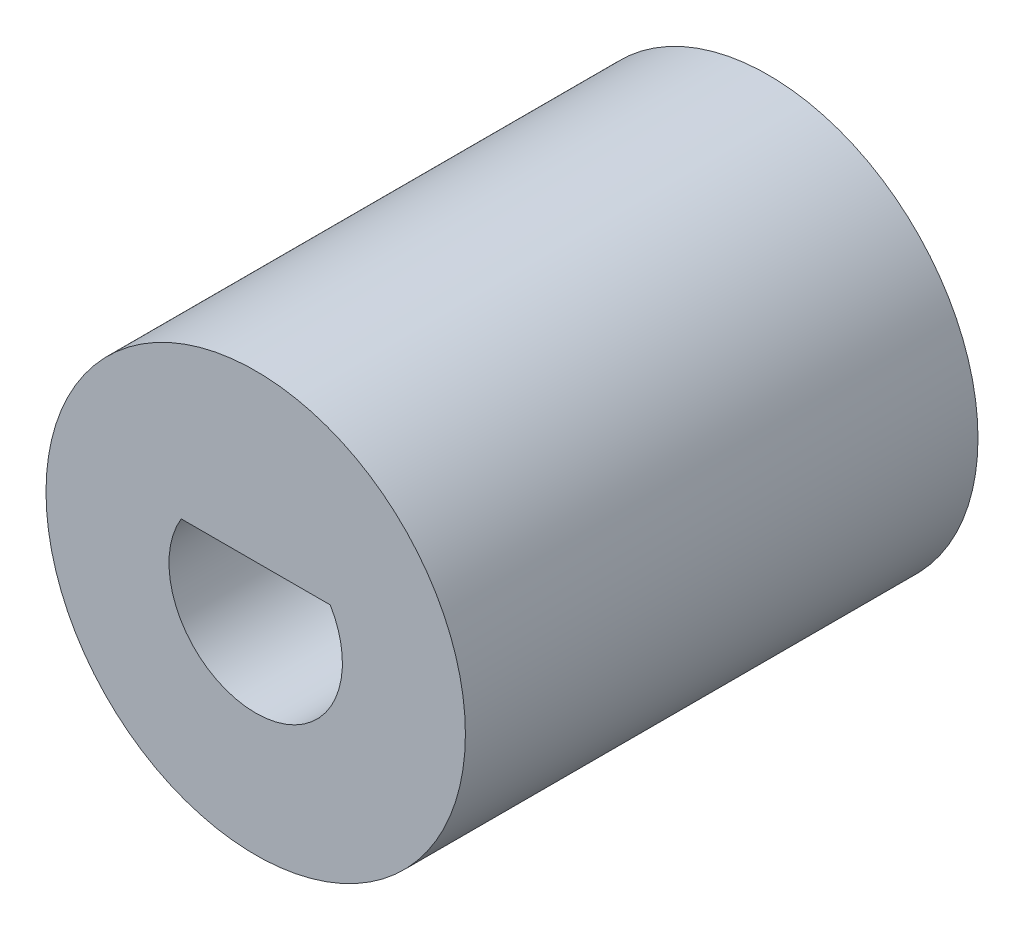
ISO-10303-21;
HEADER;
FILE_DESCRIPTION(('STEP AP214'),'2;1');
FILE_NAME('part.step','',(''),(''),'','','');
FILE_SCHEMA(('AUTOMOTIVE_DESIGN { 1 0 10303 214 1 1 1 1 }'));
ENDSEC;
DATA;
#1=APPLICATION_CONTEXT('core data for automotive mechanical design processes');
#2=APPLICATION_PROTOCOL_DEFINITION('international standard','automotive_design',2000,#1);
#3=PRODUCT_CONTEXT('',#1,'mechanical');
#4=PRODUCT('Part','Part','',(#3));
#5=PRODUCT_RELATED_PRODUCT_CATEGORY('part','',(#4));
#6=PRODUCT_DEFINITION_FORMATION('','',#4);
#7=PRODUCT_DEFINITION_CONTEXT('part definition',#1,'design');
#8=PRODUCT_DEFINITION('design','',#6,#7);
#9=PRODUCT_DEFINITION_SHAPE('','',#8);
#10=(LENGTH_UNIT() NAMED_UNIT(*) SI_UNIT(.MILLI.,.METRE.));
#11=(NAMED_UNIT(*) PLANE_ANGLE_UNIT() SI_UNIT($,.RADIAN.));
#12=(NAMED_UNIT(*) SI_UNIT($,.STERADIAN.) SOLID_ANGLE_UNIT());
#13=UNCERTAINTY_MEASURE_WITH_UNIT(LENGTH_MEASURE(1.E-05),#10,'distance_accuracy_value','');
#14=(GEOMETRIC_REPRESENTATION_CONTEXT(3) GLOBAL_UNCERTAINTY_ASSIGNED_CONTEXT((#13)) GLOBAL_UNIT_ASSIGNED_CONTEXT((#10,
#11,#12)) REPRESENTATION_CONTEXT('',''));
#15=CARTESIAN_POINT('',(0.,0.,0.));
#16=DIRECTION('',(0.,0.,1.));
#17=DIRECTION('',(1.,0.,0.));
#18=AXIS2_PLACEMENT_3D('',#15,#16,#17);
#19=CARTESIAN_POINT('',(0.,9.14557770133024,11.));
#20=DIRECTION('',(0.,0.,-1.));
#21=DIRECTION('',(-1.,0.,0.));
#22=AXIS2_PLACEMENT_3D('',#19,#20,#21);
#23=CYLINDRICAL_SURFACE('',#22,4.5);
#24=CARTESIAN_POINT('',(0.,9.14557770133024,11.));
#25=DIRECTION('',(0.,0.,1.));
#26=DIRECTION('',(1.,0.,0.));
#27=AXIS2_PLACEMENT_3D('',#24,#25,#26);
#28=CIRCLE('',#27,4.5);
#29=CARTESIAN_POINT('',(4.5,9.14557770133024,11.));
#30=VERTEX_POINT('',#29);
#31=EDGE_CURVE('E158',#30,#30,#28,.T.);
#32=ORIENTED_EDGE('',*,*,#31,.F.);
#33=EDGE_LOOP('',(#32));
#34=FACE_BOUND('',#33,.T.);
#35=CARTESIAN_POINT('',(0.,9.14557770133024,0.));
#36=DIRECTION('',(0.,0.,1.));
#37=DIRECTION('',(1.,0.,0.));
#38=AXIS2_PLACEMENT_3D('',#35,#36,#37);
#39=CIRCLE('',#38,4.5);
#40=CARTESIAN_POINT('',(4.5,9.14557770133024,0.));
#41=VERTEX_POINT('',#40);
#42=EDGE_CURVE('E147',#41,#41,#39,.T.);
#43=ORIENTED_EDGE('',*,*,#42,.T.);
#44=EDGE_LOOP('',(#43));
#45=FACE_BOUND('',#44,.T.);
#46=ADVANCED_FACE('F33',(#34,#45),#23,.T.);
#47=CARTESIAN_POINT('',(0.,9.14557770133024,11.));
#48=DIRECTION('',(0.,0.,1.));
#49=DIRECTION('',(1.,0.,0.));
#50=AXIS2_PLACEMENT_3D('',#47,#48,#49);
#51=PLANE('',#50);
#52=CARTESIAN_POINT('',(0.,9.14557770133024,11.));
#53=DIRECTION('',(0.,0.,-1.));
#54=DIRECTION('',(1.,0.,0.));
#55=AXIS2_PLACEMENT_3D('',#52,#53,#54);
#56=CIRCLE('',#55,1.86077940659284);
#57=CARTESIAN_POINT('',(1.6,10.0955777013302,11.));
#58=VERTEX_POINT('',#57);
#59=CARTESIAN_POINT('',(-1.6,10.0955777013302,11.));
#60=VERTEX_POINT('',#59);
#61=EDGE_CURVE('E47',#58,#60,#56,.T.);
#62=ORIENTED_EDGE('',*,*,#61,.T.);
#63=DIRECTION('',(1.,0.,0.));
#64=VECTOR('',#63,1.);
#65=CARTESIAN_POINT('',(-1.6,10.0955777013302,11.));
#66=LINE('',#65,#64);
#67=EDGE_CURVE('E98',#60,#58,#66,.T.);
#68=ORIENTED_EDGE('',*,*,#67,.T.);
#69=EDGE_LOOP('',(#62,#68));
#70=FACE_BOUND('',#69,.T.);
#71=ORIENTED_EDGE('',*,*,#31,.T.);
#72=EDGE_LOOP('',(#71));
#73=FACE_BOUND('',#72,.T.);
#74=ADVANCED_FACE('F104',(#70,#73),#51,.T.);
#75=CARTESIAN_POINT('',(0.,9.14557770133024,0.));
#76=DIRECTION('',(0.,0.,1.));
#77=DIRECTION('',(1.,0.,0.));
#78=AXIS2_PLACEMENT_3D('',#75,#76,#77);
#79=PLANE('',#78);
#80=DIRECTION('',(0.5,0.866025403784439,0.));
#81=VECTOR('',#80,1.);
#82=CARTESIAN_POINT('',(-3.29089653438087,9.14557770133024,0.));
#83=LINE('',#82,#81);
#84=CARTESIAN_POINT('',(-3.29089653438086,9.14557770133024,0.));
#85=VERTEX_POINT('',#84);
#86=CARTESIAN_POINT('',(-1.64544826719043,11.9955777013302,0.));
#87=VERTEX_POINT('',#86);
#88=EDGE_CURVE('E131',#85,#87,#83,.T.);
#89=ORIENTED_EDGE('',*,*,#88,.F.);
#90=DIRECTION('',(-0.5,0.866025403784439,0.));
#91=VECTOR('',#90,1.);
#92=CARTESIAN_POINT('',(-1.64544826719043,6.29557770133024,0.));
#93=LINE('',#92,#91);
#94=CARTESIAN_POINT('',(-1.64544826719043,6.29557770133024,0.));
#95=VERTEX_POINT('',#94);
#96=EDGE_CURVE('E108',#95,#85,#93,.T.);
#97=ORIENTED_EDGE('',*,*,#96,.F.);
#98=DIRECTION('',(-1.,0.,0.));
#99=VECTOR('',#98,1.);
#100=CARTESIAN_POINT('',(1.64544826719043,6.29557770133024,0.));
#101=LINE('',#100,#99);
#102=CARTESIAN_POINT('',(1.64544826719043,6.29557770133024,0.));
#103=VERTEX_POINT('',#102);
#104=EDGE_CURVE('E114',#103,#95,#101,.T.);
#105=ORIENTED_EDGE('',*,*,#104,.F.);
#106=DIRECTION('',(-0.5,-0.866025403784439,0.));
#107=VECTOR('',#106,1.);
#108=CARTESIAN_POINT('',(3.29089653438087,9.14557770133024,0.));
#109=LINE('',#108,#107);
#110=CARTESIAN_POINT('',(3.29089653438087,9.14557770133024,0.));
#111=VERTEX_POINT('',#110);
#112=EDGE_CURVE('E140',#111,#103,#109,.T.);
#113=ORIENTED_EDGE('',*,*,#112,.F.);
#114=DIRECTION('',(0.5,-0.866025403784439,0.));
#115=VECTOR('',#114,1.);
#116=CARTESIAN_POINT('',(1.64544826719043,11.9955777013302,0.));
#117=LINE('',#116,#115);
#118=CARTESIAN_POINT('',(1.64544826719043,11.9955777013302,0.));
#119=VERTEX_POINT('',#118);
#120=EDGE_CURVE('E137',#119,#111,#117,.T.);
#121=ORIENTED_EDGE('',*,*,#120,.F.);
#122=DIRECTION('',(1.,0.,0.));
#123=VECTOR('',#122,1.);
#124=CARTESIAN_POINT('',(-1.64544826719043,11.9955777013302,0.));
#125=LINE('',#124,#123);
#126=EDGE_CURVE('E134',#87,#119,#125,.T.);
#127=ORIENTED_EDGE('',*,*,#126,.F.);
#128=EDGE_LOOP('',(#89,#97,#105,#113,#121,#127));
#129=FACE_BOUND('',#128,.T.);
#130=ORIENTED_EDGE('',*,*,#42,.F.);
#131=EDGE_LOOP('',(#130));
#132=FACE_BOUND('',#131,.T.);
#133=ADVANCED_FACE('F192',(#129,#132),#79,.F.);
#134=CARTESIAN_POINT('',(-1.64544826719043,6.29557770133024,2.));
#135=DIRECTION('',(-0.866025403784439,-0.5,0.));
#136=DIRECTION('',(0.5,-0.866025403784439,0.));
#137=AXIS2_PLACEMENT_3D('',#134,#135,#136);
#138=PLANE('',#137);
#139=ORIENTED_EDGE('',*,*,#96,.T.);
#140=DIRECTION('',(0.,0.,-1.));
#141=VECTOR('',#140,1.);
#142=CARTESIAN_POINT('',(-3.29089653438087,9.14557770133024,2.));
#143=LINE('',#142,#141);
#144=CARTESIAN_POINT('',(-3.29089653438087,9.14557770133024,2.));
#145=VERTEX_POINT('',#144);
#146=EDGE_CURVE('E129',#145,#85,#143,.T.);
#147=ORIENTED_EDGE('',*,*,#146,.F.);
#148=DIRECTION('',(-0.5,0.866025403784439,0.));
#149=VECTOR('',#148,1.);
#150=CARTESIAN_POINT('',(-1.64544826719043,6.29557770133024,2.));
#151=LINE('',#150,#149);
#152=CARTESIAN_POINT('',(-1.64544826719043,6.29557770133024,2.));
#153=VERTEX_POINT('',#152);
#154=EDGE_CURVE('E110',#153,#145,#151,.T.);
#155=ORIENTED_EDGE('',*,*,#154,.F.);
#156=DIRECTION('',(0.,0.,-1.));
#157=VECTOR('',#156,1.);
#158=CARTESIAN_POINT('',(-1.64544826719043,6.29557770133024,2.));
#159=LINE('',#158,#157);
#160=EDGE_CURVE('E145',#153,#95,#159,.T.);
#161=ORIENTED_EDGE('',*,*,#160,.T.);
#162=EDGE_LOOP('',(#139,#147,#155,#161));
#163=FACE_BOUND('',#162,.T.);
#164=ADVANCED_FACE('F172',(#163),#138,.F.);
#165=CARTESIAN_POINT('',(1.64544826719043,6.29557770133024,2.));
#166=DIRECTION('',(0.,-1.,0.));
#167=DIRECTION('',(0.,0.,-1.));
#168=AXIS2_PLACEMENT_3D('',#165,#166,#167);
#169=PLANE('',#168);
#170=ORIENTED_EDGE('',*,*,#104,.T.);
#171=ORIENTED_EDGE('',*,*,#160,.F.);
#172=DIRECTION('',(-1.,0.,0.));
#173=VECTOR('',#172,1.);
#174=CARTESIAN_POINT('',(1.64544826719043,6.29557770133024,2.));
#175=LINE('',#174,#173);
#176=CARTESIAN_POINT('',(1.64544826719043,6.29557770133024,2.));
#177=VERTEX_POINT('',#176);
#178=EDGE_CURVE('E126',#177,#153,#175,.T.);
#179=ORIENTED_EDGE('',*,*,#178,.F.);
#180=DIRECTION('',(0.,0.,-1.));
#181=VECTOR('',#180,1.);
#182=CARTESIAN_POINT('',(1.64544826719043,6.29557770133024,2.));
#183=LINE('',#182,#181);
#184=EDGE_CURVE('E148',#177,#103,#183,.T.);
#185=ORIENTED_EDGE('',*,*,#184,.T.);
#186=EDGE_LOOP('',(#170,#171,#179,#185));
#187=FACE_BOUND('',#186,.T.);
#188=ADVANCED_FACE('F190',(#187),#169,.F.);
#189=CARTESIAN_POINT('',(3.29089653438087,9.14557770133024,2.));
#190=DIRECTION('',(0.866025403784439,-0.5,0.));
#191=DIRECTION('',(0.5,0.866025403784439,0.));
#192=AXIS2_PLACEMENT_3D('',#189,#190,#191);
#193=PLANE('',#192);
#194=ORIENTED_EDGE('',*,*,#112,.T.);
#195=ORIENTED_EDGE('',*,*,#184,.F.);
#196=DIRECTION('',(-0.5,-0.866025403784439,0.));
#197=VECTOR('',#196,1.);
#198=CARTESIAN_POINT('',(3.29089653438087,9.14557770133024,2.));
#199=LINE('',#198,#197);
#200=CARTESIAN_POINT('',(3.29089653438087,9.14557770133024,2.));
#201=VERTEX_POINT('',#200);
#202=EDGE_CURVE('E123',#201,#177,#199,.T.);
#203=ORIENTED_EDGE('',*,*,#202,.F.);
#204=DIRECTION('',(0.,0.,-1.));
#205=VECTOR('',#204,1.);
#206=CARTESIAN_POINT('',(3.29089653438087,9.14557770133024,2.));
#207=LINE('',#206,#205);
#208=EDGE_CURVE('E150',#201,#111,#207,.T.);
#209=ORIENTED_EDGE('',*,*,#208,.T.);
#210=EDGE_LOOP('',(#194,#195,#203,#209));
#211=FACE_BOUND('',#210,.T.);
#212=ADVANCED_FACE('F187',(#211),#193,.F.);
#213=CARTESIAN_POINT('',(1.64544826719043,11.9955777013302,2.));
#214=DIRECTION('',(0.866025403784439,0.5,0.));
#215=DIRECTION('',(-0.5,0.866025403784439,0.));
#216=AXIS2_PLACEMENT_3D('',#213,#214,#215);
#217=PLANE('',#216);
#218=ORIENTED_EDGE('',*,*,#120,.T.);
#219=ORIENTED_EDGE('',*,*,#208,.F.);
#220=DIRECTION('',(0.5,-0.866025403784439,0.));
#221=VECTOR('',#220,1.);
#222=CARTESIAN_POINT('',(1.64544826719043,11.9955777013302,2.));
#223=LINE('',#222,#221);
#224=CARTESIAN_POINT('',(1.64544826719043,11.9955777013302,2.));
#225=VERTEX_POINT('',#224);
#226=EDGE_CURVE('E120',#225,#201,#223,.T.);
#227=ORIENTED_EDGE('',*,*,#226,.F.);
#228=DIRECTION('',(0.,0.,-1.));
#229=VECTOR('',#228,1.);
#230=CARTESIAN_POINT('',(1.64544826719043,11.9955777013302,2.));
#231=LINE('',#230,#229);
#232=EDGE_CURVE('E152',#225,#119,#231,.T.);
#233=ORIENTED_EDGE('',*,*,#232,.T.);
#234=EDGE_LOOP('',(#218,#219,#227,#233));
#235=FACE_BOUND('',#234,.T.);
#236=ADVANCED_FACE('F183',(#235),#217,.F.);
#237=CARTESIAN_POINT('',(-1.64544826719043,11.9955777013302,2.));
#238=DIRECTION('',(0.,1.,0.));
#239=DIRECTION('',(0.,0.,1.));
#240=AXIS2_PLACEMENT_3D('',#237,#238,#239);
#241=PLANE('',#240);
#242=ORIENTED_EDGE('',*,*,#126,.T.);
#243=ORIENTED_EDGE('',*,*,#232,.F.);
#244=DIRECTION('',(1.,0.,0.));
#245=VECTOR('',#244,1.);
#246=CARTESIAN_POINT('',(-1.64544826719043,11.9955777013302,2.));
#247=LINE('',#246,#245);
#248=CARTESIAN_POINT('',(-1.64544826719043,11.9955777013302,2.));
#249=VERTEX_POINT('',#248);
#250=EDGE_CURVE('E117',#249,#225,#247,.T.);
#251=ORIENTED_EDGE('',*,*,#250,.F.);
#252=DIRECTION('',(0.,0.,-1.));
#253=VECTOR('',#252,1.);
#254=CARTESIAN_POINT('',(-1.64544826719043,11.9955777013302,2.));
#255=LINE('',#254,#253);
#256=EDGE_CURVE('E154',#249,#87,#255,.T.);
#257=ORIENTED_EDGE('',*,*,#256,.T.);
#258=EDGE_LOOP('',(#242,#243,#251,#257));
#259=FACE_BOUND('',#258,.T.);
#260=ADVANCED_FACE('F179',(#259),#241,.F.);
#261=CARTESIAN_POINT('',(-3.29089653438087,9.14557770133024,2.));
#262=DIRECTION('',(-0.866025403784439,0.5,0.));
#263=DIRECTION('',(-0.5,-0.866025403784439,0.));
#264=AXIS2_PLACEMENT_3D('',#261,#262,#263);
#265=PLANE('',#264);
#266=ORIENTED_EDGE('',*,*,#88,.T.);
#267=ORIENTED_EDGE('',*,*,#256,.F.);
#268=DIRECTION('',(0.5,0.866025403784439,0.));
#269=VECTOR('',#268,1.);
#270=CARTESIAN_POINT('',(-3.29089653438087,9.14557770133024,2.));
#271=LINE('',#270,#269);
#272=EDGE_CURVE('E113',#145,#249,#271,.T.);
#273=ORIENTED_EDGE('',*,*,#272,.F.);
#274=ORIENTED_EDGE('',*,*,#146,.T.);
#275=EDGE_LOOP('',(#266,#267,#273,#274));
#276=FACE_BOUND('',#275,.T.);
#277=ADVANCED_FACE('F166',(#276),#265,.F.);
#278=CARTESIAN_POINT('',(0.,0.,2.));
#279=DIRECTION('',(0.,0.,-1.));
#280=DIRECTION('',(-1.,0.,0.));
#281=AXIS2_PLACEMENT_3D('',#278,#279,#280);
#282=PLANE('',#281);
#283=CARTESIAN_POINT('',(0.,9.14557770133024,2.));
#284=DIRECTION('',(0.,0.,-1.));
#285=DIRECTION('',(-1.,0.,0.));
#286=AXIS2_PLACEMENT_3D('',#283,#284,#285);
#287=CIRCLE('',#286,1.86077940659284);
#288=CARTESIAN_POINT('',(1.6,10.0955777013302,2.));
#289=VERTEX_POINT('',#288);
#290=CARTESIAN_POINT('',(-1.6,10.0955777013302,2.));
#291=VERTEX_POINT('',#290);
#292=EDGE_CURVE('E11',#289,#291,#287,.T.);
#293=ORIENTED_EDGE('',*,*,#292,.F.);
#294=DIRECTION('',(1.,0.,0.));
#295=VECTOR('',#294,1.);
#296=CARTESIAN_POINT('',(0.,10.0955777013302,2.));
#297=LINE('',#296,#295);
#298=EDGE_CURVE('E40',#291,#289,#297,.T.);
#299=ORIENTED_EDGE('',*,*,#298,.F.);
#300=EDGE_LOOP('',(#293,#299));
#301=FACE_BOUND('',#300,.T.);
#302=ORIENTED_EDGE('',*,*,#154,.T.);
#303=ORIENTED_EDGE('',*,*,#272,.T.);
#304=ORIENTED_EDGE('',*,*,#250,.T.);
#305=ORIENTED_EDGE('',*,*,#226,.T.);
#306=ORIENTED_EDGE('',*,*,#202,.T.);
#307=ORIENTED_EDGE('',*,*,#178,.T.);
#308=EDGE_LOOP('',(#302,#303,#304,#305,#306,#307));
#309=FACE_BOUND('',#308,.T.);
#310=ADVANCED_FACE('F163',(#301,#309),#282,.T.);
#311=CARTESIAN_POINT('',(0.,9.14557770133024,11.));
#312=DIRECTION('',(0.,0.,-1.));
#313=DIRECTION('',(-1.,0.,0.));
#314=AXIS2_PLACEMENT_3D('',#311,#312,#313);
#315=CYLINDRICAL_SURFACE('',#314,1.86077940659284);
#316=ORIENTED_EDGE('',*,*,#292,.T.);
#317=DIRECTION('',(0.,0.,-1.));
#318=VECTOR('',#317,1.);
#319=CARTESIAN_POINT('',(-1.6,10.0955777013302,11.));
#320=LINE('',#319,#318);
#321=EDGE_CURVE('E54',#60,#291,#320,.T.);
#322=ORIENTED_EDGE('',*,*,#321,.F.);
#323=ORIENTED_EDGE('',*,*,#61,.F.);
#324=DIRECTION('',(0.,0.,-1.));
#325=VECTOR('',#324,1.);
#326=CARTESIAN_POINT('',(1.6,10.0955777013302,11.));
#327=LINE('',#326,#325);
#328=EDGE_CURVE('E97',#58,#289,#327,.T.);
#329=ORIENTED_EDGE('',*,*,#328,.T.);
#330=EDGE_LOOP('',(#316,#322,#323,#329));
#331=FACE_BOUND('',#330,.T.);
#332=ADVANCED_FACE('F94',(#331),#315,.F.);
#333=CARTESIAN_POINT('',(-1.6,10.0955777013302,11.));
#334=DIRECTION('',(0.,1.,0.));
#335=DIRECTION('',(0.,0.,1.));
#336=AXIS2_PLACEMENT_3D('',#333,#334,#335);
#337=PLANE('',#336);
#338=ORIENTED_EDGE('',*,*,#298,.T.);
#339=ORIENTED_EDGE('',*,*,#328,.F.);
#340=ORIENTED_EDGE('',*,*,#67,.F.);
#341=ORIENTED_EDGE('',*,*,#321,.T.);
#342=EDGE_LOOP('',(#338,#339,#340,#341));
#343=FACE_BOUND('',#342,.T.);
#344=ADVANCED_FACE('F101',(#343),#337,.F.);
#345=CLOSED_SHELL('',(#46,#74,#133,#164,#188,#212,#236,#260,#277,#310,#332,#344));
#346=MANIFOLD_SOLID_BREP('B2',#345);
#347=ADVANCED_BREP_SHAPE_REPRESENTATION('',(#18,#346),#14);
#348=SHAPE_DEFINITION_REPRESENTATION(#9,#347);
ENDSEC;
END-ISO-10303-21;
